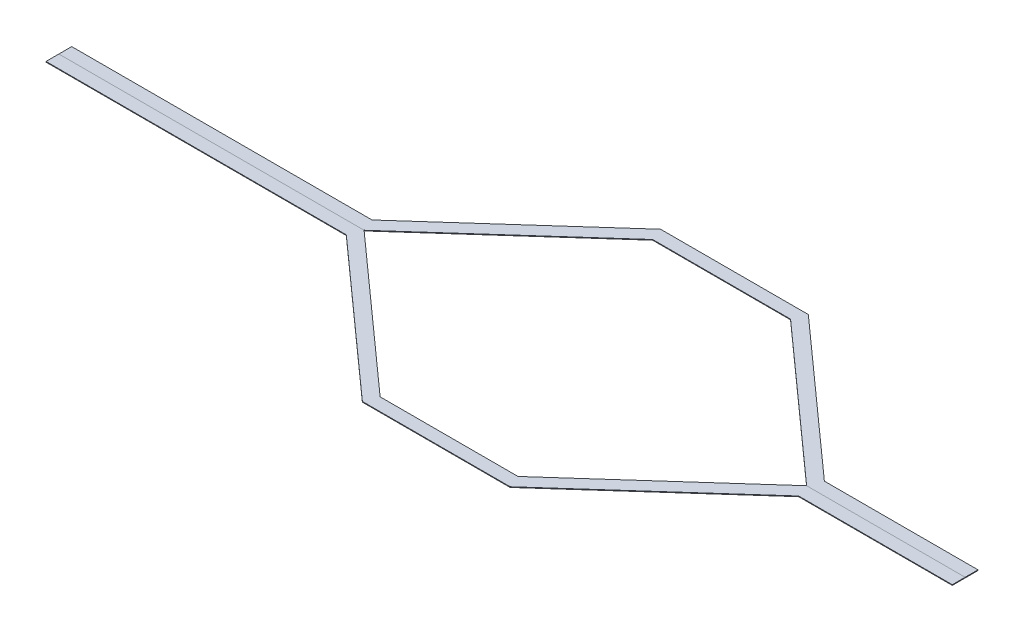
ISO-10303-21;
HEADER;
FILE_DESCRIPTION(('STEP AP214'),'2;1');
FILE_NAME('part.step','',(''),(''),'','','');
FILE_SCHEMA(('AUTOMOTIVE_DESIGN { 1 0 10303 214 1 1 1 1 }'));
ENDSEC;
DATA;
#1=APPLICATION_CONTEXT('core data for automotive mechanical design processes');
#2=APPLICATION_PROTOCOL_DEFINITION('international standard','automotive_design',2000,#1);
#3=PRODUCT_CONTEXT('',#1,'mechanical');
#4=PRODUCT('Part','Part','',(#3));
#5=PRODUCT_RELATED_PRODUCT_CATEGORY('part','',(#4));
#6=PRODUCT_DEFINITION_FORMATION('','',#4);
#7=PRODUCT_DEFINITION_CONTEXT('part definition',#1,'design');
#8=PRODUCT_DEFINITION('design','',#6,#7);
#9=PRODUCT_DEFINITION_SHAPE('','',#8);
#10=(LENGTH_UNIT() NAMED_UNIT(*) SI_UNIT(.MILLI.,.METRE.));
#11=(NAMED_UNIT(*) PLANE_ANGLE_UNIT() SI_UNIT($,.RADIAN.));
#12=(NAMED_UNIT(*) SI_UNIT($,.STERADIAN.) SOLID_ANGLE_UNIT());
#13=UNCERTAINTY_MEASURE_WITH_UNIT(LENGTH_MEASURE(1.E-05),#10,'distance_accuracy_value','');
#14=(GEOMETRIC_REPRESENTATION_CONTEXT(3) GLOBAL_UNCERTAINTY_ASSIGNED_CONTEXT((#13)) GLOBAL_UNIT_ASSIGNED_CONTEXT((#10,
#11,#12)) REPRESENTATION_CONTEXT('',''));
#15=CARTESIAN_POINT('',(0.,0.,0.));
#16=DIRECTION('',(0.,0.,1.));
#17=DIRECTION('',(1.,0.,0.));
#18=AXIS2_PLACEMENT_3D('',#15,#16,#17);
#19=CARTESIAN_POINT('',(0.,2.54,0.));
#20=DIRECTION('',(0.,1.,0.));
#21=DIRECTION('',(0.,0.,1.));
#22=AXIS2_PLACEMENT_3D('',#19,#20,#21);
#23=PLANE('',#22);
#24=DIRECTION('',(-1.,0.,0.));
#25=VECTOR('',#24,1.);
#26=CARTESIAN_POINT('',(0.,2.54,0.));
#27=LINE('',#26,#25);
#28=CARTESIAN_POINT('',(-1206.0932894328,2.54,0.));
#29=VERTEX_POINT('',#28);
#30=CARTESIAN_POINT('',(0.,2.54,0.));
#31=VERTEX_POINT('',#30);
#32=EDGE_CURVE('P0_E157',#29,#31,#27,.F.);
#33=ORIENTED_EDGE('',*,*,#32,.F.);
#34=DIRECTION('',(0.,0.,-1.));
#35=VECTOR('',#34,1.);
#36=CARTESIAN_POINT('',(-1206.0932894328,2.54,0.));
#37=LINE('',#36,#35);
#38=CARTESIAN_POINT('',(-1206.0932894328,2.54,50.8));
#39=VERTEX_POINT('',#38);
#40=EDGE_CURVE('P0_E164',#29,#39,#37,.F.);
#41=ORIENTED_EDGE('',*,*,#40,.T.);
#42=DIRECTION('',(1.,0.,0.));
#43=VECTOR('',#42,1.);
#44=CARTESIAN_POINT('',(0.,2.54,50.7999999999999));
#45=LINE('',#44,#43);
#46=CARTESIAN_POINT('',(-19.4052894327977,2.54,50.7999999999999));
#47=VERTEX_POINT('',#46);
#48=EDGE_CURVE('P0_E118',#47,#39,#45,.F.);
#49=ORIENTED_EDGE('',*,*,#48,.F.);
#50=DIRECTION('',(0.745323557128352,0.,0.666702928739285));
#51=VECTOR('',#50,1.);
#52=CARTESIAN_POINT('',(-33.8685087799556,2.54,37.8624367021202));
#53=LINE('',#52,#51);
#54=CARTESIAN_POINT('',(582.574710567202,2.54,589.28));
#55=VERTEX_POINT('',#54);
#56=EDGE_CURVE('P0_E20',#55,#47,#53,.F.);
#57=ORIENTED_EDGE('',*,*,#56,.F.);
#58=DIRECTION('',(1.,0.,0.));
#59=VECTOR('',#58,1.);
#60=CARTESIAN_POINT('',(1.12085179161461E-13,2.54,589.28));
#61=LINE('',#60,#59);
#62=CARTESIAN_POINT('',(1166.2667105672,2.54,589.28));
#63=VERTEX_POINT('',#62);
#64=EDGE_CURVE('P0_E107',#63,#55,#61,.F.);
#65=ORIENTED_EDGE('',*,*,#64,.F.);
#66=DIRECTION('',(0.745323557128352,0.,-0.666702928739285));
#67=VECTOR('',#66,1.);
#68=CARTESIAN_POINT('',(811.215920403235,2.54,906.878175167768));
#69=LINE('',#68,#67);
#70=CARTESIAN_POINT('',(1768.2467105672,2.54,50.8000000000001));
#71=VERTEX_POINT('',#70);
#72=EDGE_CURVE('P0_E102',#71,#63,#69,.F.);
#73=ORIENTED_EDGE('',*,*,#72,.F.);
#74=DIRECTION('',(1.,0.,0.));
#75=VECTOR('',#74,1.);
#76=CARTESIAN_POINT('',(0.,2.54,50.8000000000003));
#77=LINE('',#76,#75);
#78=CARTESIAN_POINT('',(2375.3067105672,2.54,50.8));
#79=VERTEX_POINT('',#78);
#80=EDGE_CURVE('P0_E129',#79,#71,#77,.F.);
#81=ORIENTED_EDGE('',*,*,#80,.F.);
#82=DIRECTION('',(0.,0.,-1.));
#83=VECTOR('',#82,1.);
#84=CARTESIAN_POINT('',(2375.3067105672,2.54,0.));
#85=LINE('',#84,#83);
#86=CARTESIAN_POINT('',(2375.3067105672,2.54,0.));
#87=VERTEX_POINT('',#86);
#88=EDGE_CURVE('P0_E133',#87,#79,#85,.F.);
#89=ORIENTED_EDGE('',*,*,#88,.F.);
#90=DIRECTION('',(-1.,0.,0.));
#91=VECTOR('',#90,1.);
#92=CARTESIAN_POINT('',(0.,2.54,0.));
#93=LINE('',#92,#91);
#94=CARTESIAN_POINT('',(1748.8414211344,2.54,-1.10593395329907E-13));
#95=VERTEX_POINT('',#94);
#96=EDGE_CURVE('P0_E137',#95,#87,#93,.F.);
#97=ORIENTED_EDGE('',*,*,#96,.F.);
#98=DIRECTION('',(0.745323557128352,0.,-0.666702928739286));
#99=VECTOR('',#98,1.);
#100=CARTESIAN_POINT('',(777.34741162328,2.54,869.015738465648));
#101=LINE('',#100,#99);
#102=CARTESIAN_POINT('',(1146.8614211344,2.54,538.48));
#103=VERTEX_POINT('',#102);
#104=EDGE_CURVE('P0_E144',#95,#103,#101,.F.);
#105=ORIENTED_EDGE('',*,*,#104,.T.);
#106=DIRECTION('',(1.,0.,0.));
#107=VECTOR('',#106,1.);
#108=CARTESIAN_POINT('',(1.09717981034389E-13,2.54,538.48));
#109=LINE('',#108,#107);
#110=CARTESIAN_POINT('',(601.98,2.54,538.48));
#111=VERTEX_POINT('',#110);
#112=EDGE_CURVE('P0_E149',#103,#111,#109,.F.);
#113=ORIENTED_EDGE('',*,*,#112,.T.);
#114=DIRECTION('',(0.745323557128352,0.,0.666702928739285));
#115=VECTOR('',#114,1.);
#116=CARTESIAN_POINT('',(0.,2.54,0.));
#117=LINE('',#116,#115);
#118=EDGE_CURVE('P0_E154',#111,#31,#117,.F.);
#119=ORIENTED_EDGE('',*,*,#118,.T.);
#120=EDGE_LOOP('',(#33,#41,#49,#57,#65,#73,#81,#89,#97,#105,#113,#119));
#121=FACE_BOUND('',#120,.T.);
#122=ADVANCED_FACE('P0_F17',(#121),#23,.T.);
#123=CARTESIAN_POINT('',(-33.8685087799556,2.54,37.8624367021202));
#124=DIRECTION('',(-0.666702928739285,0.,0.745323557128352));
#125=DIRECTION('',(0.745323557128352,0.,0.666702928739285));
#126=AXIS2_PLACEMENT_3D('',#123,#124,#125);
#127=PLANE('',#126);
#128=ORIENTED_EDGE('',*,*,#56,.T.);
#129=DIRECTION('',(0.,1.,0.));
#130=VECTOR('',#129,1.);
#131=CARTESIAN_POINT('',(-19.4052894327978,2.54,50.7999999999999));
#132=LINE('',#131,#130);
#133=CARTESIAN_POINT('',(-19.4052894327977,0.,50.7999999999999));
#134=VERTEX_POINT('',#133);
#135=EDGE_CURVE('P0_E166',#134,#47,#132,.T.);
#136=ORIENTED_EDGE('',*,*,#135,.F.);
#137=DIRECTION('',(0.745323557128352,0.,0.666702928739285));
#138=VECTOR('',#137,1.);
#139=CARTESIAN_POINT('',(-19.4052894327978,0.,50.7999999999998));
#140=LINE('',#139,#138);
#141=CARTESIAN_POINT('',(582.574710567202,0.,589.28));
#142=VERTEX_POINT('',#141);
#143=EDGE_CURVE('P0_E124',#134,#142,#140,.T.);
#144=ORIENTED_EDGE('',*,*,#143,.T.);
#145=DIRECTION('',(0.,1.,0.));
#146=VECTOR('',#145,1.);
#147=CARTESIAN_POINT('',(582.574710567202,2.54,589.28));
#148=LINE('',#147,#146);
#149=EDGE_CURVE('P0_E112',#55,#142,#148,.F.);
#150=ORIENTED_EDGE('',*,*,#149,.F.);
#151=EDGE_LOOP('',(#128,#136,#144,#150));
#152=FACE_BOUND('',#151,.T.);
#153=ADVANCED_FACE('P0_F123',(#152),#127,.T.);
#154=CARTESIAN_POINT('',(1.12085179161461E-13,2.54,589.28));
#155=DIRECTION('',(0.,0.,1.));
#156=DIRECTION('',(1.,0.,0.));
#157=AXIS2_PLACEMENT_3D('',#154,#155,#156);
#158=PLANE('',#157);
#159=ORIENTED_EDGE('',*,*,#64,.T.);
#160=ORIENTED_EDGE('',*,*,#149,.T.);
#161=DIRECTION('',(1.,0.,0.));
#162=VECTOR('',#161,1.);
#163=CARTESIAN_POINT('',(0.,0.,589.28));
#164=LINE('',#163,#162);
#165=CARTESIAN_POINT('',(1166.2667105672,0.,589.28));
#166=VERTEX_POINT('',#165);
#167=EDGE_CURVE('P0_E171',#142,#166,#164,.T.);
#168=ORIENTED_EDGE('',*,*,#167,.T.);
#169=DIRECTION('',(0.,1.,0.));
#170=VECTOR('',#169,1.);
#171=CARTESIAN_POINT('',(1166.2667105672,2.54,589.28));
#172=LINE('',#171,#170);
#173=EDGE_CURVE('P0_E114',#63,#166,#172,.F.);
#174=ORIENTED_EDGE('',*,*,#173,.F.);
#175=EDGE_LOOP('',(#159,#160,#168,#174));
#176=FACE_BOUND('',#175,.T.);
#177=ADVANCED_FACE('P0_F109',(#176),#158,.T.);
#178=CARTESIAN_POINT('',(811.215920403235,2.54,906.878175167768));
#179=DIRECTION('',(0.666702928739285,0.,0.745323557128352));
#180=DIRECTION('',(0.745323557128352,0.,-0.666702928739285));
#181=AXIS2_PLACEMENT_3D('',#178,#179,#180);
#182=PLANE('',#181);
#183=ORIENTED_EDGE('',*,*,#72,.T.);
#184=ORIENTED_EDGE('',*,*,#173,.T.);
#185=DIRECTION('',(0.745323557128352,0.,-0.666702928739285));
#186=VECTOR('',#185,1.);
#187=CARTESIAN_POINT('',(1166.2667105672,0.,589.28));
#188=LINE('',#187,#186);
#189=CARTESIAN_POINT('',(1768.2467105672,0.,50.8000000000001));
#190=VERTEX_POINT('',#189);
#191=EDGE_CURVE('P0_E173',#166,#190,#188,.T.);
#192=ORIENTED_EDGE('',*,*,#191,.T.);
#193=DIRECTION('',(0.,1.,0.));
#194=VECTOR('',#193,1.);
#195=CARTESIAN_POINT('',(1768.2467105672,2.54,50.8000000000001));
#196=LINE('',#195,#194);
#197=EDGE_CURVE('P0_E131',#71,#190,#196,.F.);
#198=ORIENTED_EDGE('',*,*,#197,.F.);
#199=EDGE_LOOP('',(#183,#184,#192,#198));
#200=FACE_BOUND('',#199,.T.);
#201=ADVANCED_FACE('P0_F234',(#200),#182,.T.);
#202=CARTESIAN_POINT('',(0.,2.54,50.8000000000003));
#203=DIRECTION('',(0.,0.,1.));
#204=DIRECTION('',(1.,0.,0.));
#205=AXIS2_PLACEMENT_3D('',#202,#203,#204);
#206=PLANE('',#205);
#207=ORIENTED_EDGE('',*,*,#80,.T.);
#208=ORIENTED_EDGE('',*,*,#197,.T.);
#209=DIRECTION('',(1.,0.,0.));
#210=VECTOR('',#209,1.);
#211=CARTESIAN_POINT('',(0.,0.,50.8000000000001));
#212=LINE('',#211,#210);
#213=CARTESIAN_POINT('',(2375.3067105672,0.,50.8));
#214=VERTEX_POINT('',#213);
#215=EDGE_CURVE('P0_E176',#190,#214,#212,.T.);
#216=ORIENTED_EDGE('',*,*,#215,.T.);
#217=DIRECTION('',(0.,1.,0.));
#218=VECTOR('',#217,1.);
#219=CARTESIAN_POINT('',(2375.3067105672,2.54,50.8));
#220=LINE('',#219,#218);
#221=EDGE_CURVE('P0_E135',#79,#214,#220,.F.);
#222=ORIENTED_EDGE('',*,*,#221,.F.);
#223=EDGE_LOOP('',(#207,#208,#216,#222));
#224=FACE_BOUND('',#223,.T.);
#225=ADVANCED_FACE('P0_F233',(#224),#206,.T.);
#226=CARTESIAN_POINT('',(2375.3067105672,2.54,0.));
#227=DIRECTION('',(1.,0.,0.));
#228=DIRECTION('',(0.,0.,-1.));
#229=AXIS2_PLACEMENT_3D('',#226,#227,#228);
#230=PLANE('',#229);
#231=ORIENTED_EDGE('',*,*,#88,.T.);
#232=ORIENTED_EDGE('',*,*,#221,.T.);
#233=DIRECTION('',(0.,0.,1.));
#234=VECTOR('',#233,1.);
#235=CARTESIAN_POINT('',(2375.3067105672,0.,0.));
#236=LINE('',#235,#234);
#237=CARTESIAN_POINT('',(2375.3067105672,0.,0.));
#238=VERTEX_POINT('',#237);
#239=EDGE_CURVE('P0_E179',#214,#238,#236,.F.);
#240=ORIENTED_EDGE('',*,*,#239,.T.);
#241=DIRECTION('',(0.,1.,0.));
#242=VECTOR('',#241,1.);
#243=CARTESIAN_POINT('',(2375.3067105672,2.54,0.));
#244=LINE('',#243,#242);
#245=EDGE_CURVE('P0_E139',#87,#238,#244,.F.);
#246=ORIENTED_EDGE('',*,*,#245,.F.);
#247=EDGE_LOOP('',(#231,#232,#240,#246));
#248=FACE_BOUND('',#247,.T.);
#249=ADVANCED_FACE('P0_F227',(#248),#230,.T.);
#250=CARTESIAN_POINT('',(0.,2.54,0.));
#251=DIRECTION('',(0.,0.,-1.));
#252=DIRECTION('',(-1.,0.,0.));
#253=AXIS2_PLACEMENT_3D('',#250,#251,#252);
#254=PLANE('',#253);
#255=ORIENTED_EDGE('',*,*,#96,.T.);
#256=ORIENTED_EDGE('',*,*,#245,.T.);
#257=DIRECTION('',(1.,0.,0.));
#258=VECTOR('',#257,1.);
#259=CARTESIAN_POINT('',(0.,0.,0.));
#260=LINE('',#259,#258);
#261=CARTESIAN_POINT('',(1748.8414211344,0.,-1.10593395329907E-13));
#262=VERTEX_POINT('',#261);
#263=EDGE_CURVE('P0_E182',#238,#262,#260,.F.);
#264=ORIENTED_EDGE('',*,*,#263,.T.);
#265=DIRECTION('',(0.,1.,0.));
#266=VECTOR('',#265,1.);
#267=CARTESIAN_POINT('',(1748.8414211344,2.54,-1.11022302462516E-13));
#268=LINE('',#267,#266);
#269=EDGE_CURVE('P0_E141',#262,#95,#268,.T.);
#270=ORIENTED_EDGE('',*,*,#269,.T.);
#271=EDGE_LOOP('',(#255,#256,#264,#270));
#272=FACE_BOUND('',#271,.T.);
#273=ADVANCED_FACE('P0_F223',(#272),#254,.T.);
#274=CARTESIAN_POINT('',(777.34741162328,2.54,869.015738465648));
#275=DIRECTION('',(0.666702928739286,0.,0.745323557128352));
#276=DIRECTION('',(0.745323557128352,0.,-0.666702928739286));
#277=AXIS2_PLACEMENT_3D('',#274,#275,#276);
#278=PLANE('',#277);
#279=DIRECTION('',(0.,1.,0.));
#280=VECTOR('',#279,1.);
#281=CARTESIAN_POINT('',(1146.8614211344,2.54,538.48));
#282=LINE('',#281,#280);
#283=CARTESIAN_POINT('',(1146.8614211344,0.,538.48));
#284=VERTEX_POINT('',#283);
#285=EDGE_CURVE('P0_E146',#284,#103,#282,.T.);
#286=ORIENTED_EDGE('',*,*,#285,.T.);
#287=ORIENTED_EDGE('',*,*,#104,.F.);
#288=ORIENTED_EDGE('',*,*,#269,.F.);
#289=DIRECTION('',(-0.745323557128352,0.,0.666702928739285));
#290=VECTOR('',#289,1.);
#291=CARTESIAN_POINT('',(1748.8414211344,0.,0.));
#292=LINE('',#291,#290);
#293=EDGE_CURVE('P0_E185',#262,#284,#292,.T.);
#294=ORIENTED_EDGE('',*,*,#293,.T.);
#295=EDGE_LOOP('',(#286,#287,#288,#294));
#296=FACE_BOUND('',#295,.T.);
#297=ADVANCED_FACE('P0_F219',(#296),#278,.F.);
#298=CARTESIAN_POINT('',(1.09717981034389E-13,2.54,538.48));
#299=DIRECTION('',(0.,0.,1.));
#300=DIRECTION('',(1.,0.,0.));
#301=AXIS2_PLACEMENT_3D('',#298,#299,#300);
#302=PLANE('',#301);
#303=DIRECTION('',(0.,1.,0.));
#304=VECTOR('',#303,1.);
#305=CARTESIAN_POINT('',(601.98,2.54,538.48));
#306=LINE('',#305,#304);
#307=CARTESIAN_POINT('',(601.98,0.,538.48));
#308=VERTEX_POINT('',#307);
#309=EDGE_CURVE('P0_E151',#308,#111,#306,.T.);
#310=ORIENTED_EDGE('',*,*,#309,.T.);
#311=ORIENTED_EDGE('',*,*,#112,.F.);
#312=ORIENTED_EDGE('',*,*,#285,.F.);
#313=DIRECTION('',(1.,0.,0.));
#314=VECTOR('',#313,1.);
#315=CARTESIAN_POINT('',(0.,0.,538.48));
#316=LINE('',#315,#314);
#317=EDGE_CURVE('P0_E188',#284,#308,#316,.F.);
#318=ORIENTED_EDGE('',*,*,#317,.T.);
#319=EDGE_LOOP('',(#310,#311,#312,#318));
#320=FACE_BOUND('',#319,.T.);
#321=ADVANCED_FACE('P0_F215',(#320),#302,.F.);
#322=CARTESIAN_POINT('',(0.,2.54,0.));
#323=DIRECTION('',(-0.666702928739285,0.,0.745323557128352));
#324=DIRECTION('',(0.745323557128352,0.,0.666702928739285));
#325=AXIS2_PLACEMENT_3D('',#322,#323,#324);
#326=PLANE('',#325);
#327=DIRECTION('',(0.,1.,0.));
#328=VECTOR('',#327,1.);
#329=CARTESIAN_POINT('',(0.,2.54,0.));
#330=LINE('',#329,#328);
#331=CARTESIAN_POINT('',(0.,0.,0.));
#332=VERTEX_POINT('',#331);
#333=EDGE_CURVE('P0_E159',#31,#332,#330,.F.);
#334=ORIENTED_EDGE('',*,*,#333,.F.);
#335=ORIENTED_EDGE('',*,*,#118,.F.);
#336=ORIENTED_EDGE('',*,*,#309,.F.);
#337=DIRECTION('',(-0.745323557128352,0.,-0.666702928739285));
#338=VECTOR('',#337,1.);
#339=CARTESIAN_POINT('',(601.98,0.,538.48));
#340=LINE('',#339,#338);
#341=EDGE_CURVE('P0_E191',#308,#332,#340,.T.);
#342=ORIENTED_EDGE('',*,*,#341,.T.);
#343=EDGE_LOOP('',(#334,#335,#336,#342));
#344=FACE_BOUND('',#343,.T.);
#345=ADVANCED_FACE('P0_F211',(#344),#326,.F.);
#346=CARTESIAN_POINT('',(0.,2.54,0.));
#347=DIRECTION('',(0.,0.,-1.));
#348=DIRECTION('',(-1.,0.,0.));
#349=AXIS2_PLACEMENT_3D('',#346,#347,#348);
#350=PLANE('',#349);
#351=ORIENTED_EDGE('',*,*,#32,.T.);
#352=ORIENTED_EDGE('',*,*,#333,.T.);
#353=DIRECTION('',(1.,0.,0.));
#354=VECTOR('',#353,1.);
#355=CARTESIAN_POINT('',(0.,0.,0.));
#356=LINE('',#355,#354);
#357=CARTESIAN_POINT('',(-1206.0932894328,0.,0.));
#358=VERTEX_POINT('',#357);
#359=EDGE_CURVE('P0_E194',#332,#358,#356,.F.);
#360=ORIENTED_EDGE('',*,*,#359,.T.);
#361=DIRECTION('',(0.,1.,0.));
#362=VECTOR('',#361,1.);
#363=CARTESIAN_POINT('',(-1206.0932894328,2.54,0.));
#364=LINE('',#363,#362);
#365=EDGE_CURVE('P0_E161',#358,#29,#364,.T.);
#366=ORIENTED_EDGE('',*,*,#365,.T.);
#367=EDGE_LOOP('',(#351,#352,#360,#366));
#368=FACE_BOUND('',#367,.T.);
#369=ADVANCED_FACE('P0_F207',(#368),#350,.T.);
#370=CARTESIAN_POINT('',(-1206.0932894328,2.54,0.));
#371=DIRECTION('',(1.,0.,0.));
#372=DIRECTION('',(0.,0.,-1.));
#373=AXIS2_PLACEMENT_3D('',#370,#371,#372);
#374=PLANE('',#373);
#375=DIRECTION('',(0.,1.,0.));
#376=VECTOR('',#375,1.);
#377=CARTESIAN_POINT('',(-1206.0932894328,2.54,50.8));
#378=LINE('',#377,#376);
#379=CARTESIAN_POINT('',(-1206.0932894328,0.,50.8));
#380=VERTEX_POINT('',#379);
#381=EDGE_CURVE('P0_E34',#39,#380,#378,.F.);
#382=ORIENTED_EDGE('',*,*,#381,.F.);
#383=ORIENTED_EDGE('',*,*,#40,.F.);
#384=ORIENTED_EDGE('',*,*,#365,.F.);
#385=DIRECTION('',(0.,0.,1.));
#386=VECTOR('',#385,1.);
#387=CARTESIAN_POINT('',(-1206.0932894328,0.,0.));
#388=LINE('',#387,#386);
#389=EDGE_CURVE('P0_E26',#358,#380,#388,.T.);
#390=ORIENTED_EDGE('',*,*,#389,.T.);
#391=EDGE_LOOP('',(#382,#383,#384,#390));
#392=FACE_BOUND('',#391,.T.);
#393=ADVANCED_FACE('P0_F200',(#392),#374,.F.);
#394=CARTESIAN_POINT('',(0.,2.54,50.7999999999999));
#395=DIRECTION('',(0.,0.,1.));
#396=DIRECTION('',(1.,0.,0.));
#397=AXIS2_PLACEMENT_3D('',#394,#395,#396);
#398=PLANE('',#397);
#399=ORIENTED_EDGE('',*,*,#48,.T.);
#400=ORIENTED_EDGE('',*,*,#381,.T.);
#401=DIRECTION('',(1.,0.,0.));
#402=VECTOR('',#401,1.);
#403=CARTESIAN_POINT('',(0.,0.,50.8));
#404=LINE('',#403,#402);
#405=EDGE_CURVE('P0_E11',#380,#134,#404,.T.);
#406=ORIENTED_EDGE('',*,*,#405,.T.);
#407=ORIENTED_EDGE('',*,*,#135,.T.);
#408=EDGE_LOOP('',(#399,#400,#406,#407));
#409=FACE_BOUND('',#408,.T.);
#410=ADVANCED_FACE('P0_F235',(#409),#398,.T.);
#411=CARTESIAN_POINT('',(0.,0.,0.));
#412=DIRECTION('',(0.,1.,0.));
#413=DIRECTION('',(0.,0.,1.));
#414=AXIS2_PLACEMENT_3D('',#411,#412,#413);
#415=PLANE('',#414);
#416=ORIENTED_EDGE('',*,*,#389,.F.);
#417=ORIENTED_EDGE('',*,*,#359,.F.);
#418=ORIENTED_EDGE('',*,*,#341,.F.);
#419=ORIENTED_EDGE('',*,*,#317,.F.);
#420=ORIENTED_EDGE('',*,*,#293,.F.);
#421=ORIENTED_EDGE('',*,*,#263,.F.);
#422=ORIENTED_EDGE('',*,*,#239,.F.);
#423=ORIENTED_EDGE('',*,*,#215,.F.);
#424=ORIENTED_EDGE('',*,*,#191,.F.);
#425=ORIENTED_EDGE('',*,*,#167,.F.);
#426=ORIENTED_EDGE('',*,*,#143,.F.);
#427=ORIENTED_EDGE('',*,*,#405,.F.);
#428=EDGE_LOOP('',(#416,#417,#418,#419,#420,#421,#422,#423,#424,#425,#426,#427));
#429=FACE_BOUND('',#428,.T.);
#430=ADVANCED_FACE('P0_F204',(#429),#415,.F.);
#431=CLOSED_SHELL('',(#122,#153,#177,#201,#225,#249,#273,#297,#321,#345,#369,#393,#410,#430));
#432=MANIFOLD_SOLID_BREP('P0_B1',#431);
#433=CARTESIAN_POINT('',(0.,2.54,0.));
#434=DIRECTION('',(0.,1.,0.));
#435=DIRECTION('',(0.,0.,1.));
#436=AXIS2_PLACEMENT_3D('',#433,#434,#435);
#437=PLANE('',#436);
#438=DIRECTION('',(-1.,0.,0.));
#439=VECTOR('',#438,1.);
#440=CARTESIAN_POINT('',(0.,2.54,0.));
#441=LINE('',#440,#439);
#442=CARTESIAN_POINT('',(1748.8414211344,2.54,0.));
#443=VERTEX_POINT('',#442);
#444=CARTESIAN_POINT('',(2375.3067105672,2.54,0.));
#445=VERTEX_POINT('',#444);
#446=EDGE_CURVE('P1_E162',#443,#445,#441,.F.);
#447=ORIENTED_EDGE('',*,*,#446,.T.);
#448=DIRECTION('',(0.,0.,-1.));
#449=VECTOR('',#448,1.);
#450=CARTESIAN_POINT('',(2375.3067105672,2.54,0.));
#451=LINE('',#450,#449);
#452=CARTESIAN_POINT('',(2375.3067105672,2.54,-50.8));
#453=VERTEX_POINT('',#452);
#454=EDGE_CURVE('P1_E164',#453,#445,#451,.F.);
#455=ORIENTED_EDGE('',*,*,#454,.F.);
#456=DIRECTION('',(-1.,0.,0.));
#457=VECTOR('',#456,1.);
#458=CARTESIAN_POINT('',(0.,2.54,-50.8));
#459=LINE('',#458,#457);
#460=CARTESIAN_POINT('',(1768.2467105672,2.54,-50.8000000000003));
#461=VERTEX_POINT('',#460);
#462=EDGE_CURVE('P1_E119',#461,#453,#459,.F.);
#463=ORIENTED_EDGE('',*,*,#462,.F.);
#464=DIRECTION('',(-0.745323557128352,0.,-0.666702928739285));
#465=VECTOR('',#464,1.);
#466=CARTESIAN_POINT('',(811.215920403235,2.54,-906.878175167768));
#467=LINE('',#466,#465);
#468=CARTESIAN_POINT('',(1166.2667105672,2.54,-589.28));
#469=VERTEX_POINT('',#468);
#470=EDGE_CURVE('P1_E20',#469,#461,#467,.F.);
#471=ORIENTED_EDGE('',*,*,#470,.F.);
#472=DIRECTION('',(-1.,0.,0.));
#473=VECTOR('',#472,1.);
#474=CARTESIAN_POINT('',(0.,2.54,-589.28));
#475=LINE('',#474,#473);
#476=CARTESIAN_POINT('',(582.574710567202,2.54,-589.28));
#477=VERTEX_POINT('',#476);
#478=EDGE_CURVE('P1_E107',#477,#469,#475,.F.);
#479=ORIENTED_EDGE('',*,*,#478,.F.);
#480=DIRECTION('',(-0.745323557128352,0.,0.666702928739285));
#481=VECTOR('',#480,1.);
#482=CARTESIAN_POINT('',(-33.8685087799557,2.54,-37.8624367021203));
#483=LINE('',#482,#481);
#484=CARTESIAN_POINT('',(-19.4052894327977,2.54,-50.8));
#485=VERTEX_POINT('',#484);
#486=EDGE_CURVE('P1_E102',#485,#477,#483,.F.);
#487=ORIENTED_EDGE('',*,*,#486,.F.);
#488=DIRECTION('',(-1.,0.,0.));
#489=VECTOR('',#488,1.);
#490=CARTESIAN_POINT('',(0.,2.54,-50.8));
#491=LINE('',#490,#489);
#492=CARTESIAN_POINT('',(-1206.0932894328,2.54,-50.8));
#493=VERTEX_POINT('',#492);
#494=EDGE_CURVE('P1_E130',#493,#485,#491,.F.);
#495=ORIENTED_EDGE('',*,*,#494,.F.);
#496=DIRECTION('',(0.,0.,-1.));
#497=VECTOR('',#496,1.);
#498=CARTESIAN_POINT('',(-1206.0932894328,2.54,0.));
#499=LINE('',#498,#497);
#500=CARTESIAN_POINT('',(-1206.0932894328,2.54,0.));
#501=VERTEX_POINT('',#500);
#502=EDGE_CURVE('P1_E137',#493,#501,#499,.F.);
#503=ORIENTED_EDGE('',*,*,#502,.T.);
#504=DIRECTION('',(-1.,0.,0.));
#505=VECTOR('',#504,1.);
#506=CARTESIAN_POINT('',(0.,2.54,0.));
#507=LINE('',#506,#505);
#508=CARTESIAN_POINT('',(0.,2.54,0.));
#509=VERTEX_POINT('',#508);
#510=EDGE_CURVE('P1_E142',#501,#509,#507,.F.);
#511=ORIENTED_EDGE('',*,*,#510,.T.);
#512=DIRECTION('',(-0.745323557128352,0.,0.666702928739285));
#513=VECTOR('',#512,1.);
#514=CARTESIAN_POINT('',(0.,2.54,0.));
#515=LINE('',#514,#513);
#516=CARTESIAN_POINT('',(601.98,2.54,-538.48));
#517=VERTEX_POINT('',#516);
#518=EDGE_CURVE('P1_E147',#509,#517,#515,.F.);
#519=ORIENTED_EDGE('',*,*,#518,.T.);
#520=DIRECTION('',(-1.,0.,0.));
#521=VECTOR('',#520,1.);
#522=CARTESIAN_POINT('',(0.,2.54,-538.48));
#523=LINE('',#522,#521);
#524=CARTESIAN_POINT('',(1146.8614211344,2.54,-538.48));
#525=VERTEX_POINT('',#524);
#526=EDGE_CURVE('P1_E152',#517,#525,#523,.F.);
#527=ORIENTED_EDGE('',*,*,#526,.T.);
#528=DIRECTION('',(-0.745323557128352,0.,-0.666702928739285));
#529=VECTOR('',#528,1.);
#530=CARTESIAN_POINT('',(777.34741162328,2.54,-869.015738465647));
#531=LINE('',#530,#529);
#532=EDGE_CURVE('P1_E157',#525,#443,#531,.F.);
#533=ORIENTED_EDGE('',*,*,#532,.T.);
#534=EDGE_LOOP('',(#447,#455,#463,#471,#479,#487,#495,#503,#511,#519,#527,#533));
#535=FACE_BOUND('',#534,.T.);
#536=ADVANCED_FACE('P1_F17',(#535),#437,.T.);
#537=CARTESIAN_POINT('',(811.215920403235,2.54,-906.878175167768));
#538=DIRECTION('',(0.666702928739285,0.,-0.745323557128352));
#539=DIRECTION('',(-0.745323557128352,0.,-0.666702928739285));
#540=AXIS2_PLACEMENT_3D('',#537,#538,#539);
#541=PLANE('',#540);
#542=ORIENTED_EDGE('',*,*,#470,.T.);
#543=DIRECTION('',(0.,1.,0.));
#544=VECTOR('',#543,1.);
#545=CARTESIAN_POINT('',(1768.2467105672,2.54,-50.8));
#546=LINE('',#545,#544);
#547=CARTESIAN_POINT('',(1768.2467105672,0.,-50.8000000000003));
#548=VERTEX_POINT('',#547);
#549=EDGE_CURVE('P1_E168',#548,#461,#546,.T.);
#550=ORIENTED_EDGE('',*,*,#549,.F.);
#551=DIRECTION('',(-0.745323557128352,0.,-0.666702928739285));
#552=VECTOR('',#551,1.);
#553=CARTESIAN_POINT('',(1768.2467105672,0.,-50.8000000000004));
#554=LINE('',#553,#552);
#555=CARTESIAN_POINT('',(1166.2667105672,0.,-589.28));
#556=VERTEX_POINT('',#555);
#557=EDGE_CURVE('P1_E125',#548,#556,#554,.T.);
#558=ORIENTED_EDGE('',*,*,#557,.T.);
#559=DIRECTION('',(0.,1.,0.));
#560=VECTOR('',#559,1.);
#561=CARTESIAN_POINT('',(1166.2667105672,2.54,-589.28));
#562=LINE('',#561,#560);
#563=EDGE_CURVE('P1_E112',#469,#556,#562,.F.);
#564=ORIENTED_EDGE('',*,*,#563,.F.);
#565=EDGE_LOOP('',(#542,#550,#558,#564));
#566=FACE_BOUND('',#565,.T.);
#567=ADVANCED_FACE('P1_F124',(#566),#541,.T.);
#568=CARTESIAN_POINT('',(0.,2.54,-589.28));
#569=DIRECTION('',(0.,0.,-1.));
#570=DIRECTION('',(-1.,0.,0.));
#571=AXIS2_PLACEMENT_3D('',#568,#569,#570);
#572=PLANE('',#571);
#573=ORIENTED_EDGE('',*,*,#478,.T.);
#574=ORIENTED_EDGE('',*,*,#563,.T.);
#575=DIRECTION('',(1.,0.,0.));
#576=VECTOR('',#575,1.);
#577=CARTESIAN_POINT('',(0.,0.,-589.28));
#578=LINE('',#577,#576);
#579=CARTESIAN_POINT('',(582.574710567202,0.,-589.28));
#580=VERTEX_POINT('',#579);
#581=EDGE_CURVE('P1_E173',#556,#580,#578,.F.);
#582=ORIENTED_EDGE('',*,*,#581,.T.);
#583=DIRECTION('',(0.,1.,0.));
#584=VECTOR('',#583,1.);
#585=CARTESIAN_POINT('',(582.574710567202,2.54,-589.28));
#586=LINE('',#585,#584);
#587=EDGE_CURVE('P1_E114',#477,#580,#586,.F.);
#588=ORIENTED_EDGE('',*,*,#587,.F.);
#589=EDGE_LOOP('',(#573,#574,#582,#588));
#590=FACE_BOUND('',#589,.T.);
#591=ADVANCED_FACE('P1_F109',(#590),#572,.T.);
#592=CARTESIAN_POINT('',(-33.8685087799557,2.54,-37.8624367021203));
#593=DIRECTION('',(-0.666702928739285,0.,-0.745323557128352));
#594=DIRECTION('',(-0.745323557128352,0.,0.666702928739285));
#595=AXIS2_PLACEMENT_3D('',#592,#593,#594);
#596=PLANE('',#595);
#597=ORIENTED_EDGE('',*,*,#486,.T.);
#598=ORIENTED_EDGE('',*,*,#587,.T.);
#599=DIRECTION('',(-0.745323557128352,0.,0.666702928739285));
#600=VECTOR('',#599,1.);
#601=CARTESIAN_POINT('',(582.574710567202,0.,-589.28));
#602=LINE('',#601,#600);
#603=CARTESIAN_POINT('',(-19.4052894327978,0.,-50.8));
#604=VERTEX_POINT('',#603);
#605=EDGE_CURVE('P1_E175',#580,#604,#602,.T.);
#606=ORIENTED_EDGE('',*,*,#605,.T.);
#607=DIRECTION('',(0.,1.,0.));
#608=VECTOR('',#607,1.);
#609=CARTESIAN_POINT('',(-19.4052894327978,2.54,-50.8));
#610=LINE('',#609,#608);
#611=EDGE_CURVE('P1_E132',#485,#604,#610,.F.);
#612=ORIENTED_EDGE('',*,*,#611,.F.);
#613=EDGE_LOOP('',(#597,#598,#606,#612));
#614=FACE_BOUND('',#613,.T.);
#615=ADVANCED_FACE('P1_F234',(#614),#596,.T.);
#616=CARTESIAN_POINT('',(0.,2.54,-50.8));
#617=DIRECTION('',(0.,0.,-1.));
#618=DIRECTION('',(-1.,0.,0.));
#619=AXIS2_PLACEMENT_3D('',#616,#617,#618);
#620=PLANE('',#619);
#621=ORIENTED_EDGE('',*,*,#494,.T.);
#622=ORIENTED_EDGE('',*,*,#611,.T.);
#623=DIRECTION('',(1.,0.,0.));
#624=VECTOR('',#623,1.);
#625=CARTESIAN_POINT('',(0.,0.,-50.8));
#626=LINE('',#625,#624);
#627=CARTESIAN_POINT('',(-1206.0932894328,0.,-50.8));
#628=VERTEX_POINT('',#627);
#629=EDGE_CURVE('P1_E178',#604,#628,#626,.F.);
#630=ORIENTED_EDGE('',*,*,#629,.T.);
#631=DIRECTION('',(0.,1.,0.));
#632=VECTOR('',#631,1.);
#633=CARTESIAN_POINT('',(-1206.0932894328,2.54,-50.8));
#634=LINE('',#633,#632);
#635=EDGE_CURVE('P1_E134',#628,#493,#634,.T.);
#636=ORIENTED_EDGE('',*,*,#635,.T.);
#637=EDGE_LOOP('',(#621,#622,#630,#636));
#638=FACE_BOUND('',#637,.T.);
#639=ADVANCED_FACE('P1_F233',(#638),#620,.T.);
#640=CARTESIAN_POINT('',(-1206.0932894328,2.54,0.));
#641=DIRECTION('',(1.,0.,0.));
#642=DIRECTION('',(0.,0.,-1.));
#643=AXIS2_PLACEMENT_3D('',#640,#641,#642);
#644=PLANE('',#643);
#645=DIRECTION('',(0.,1.,0.));
#646=VECTOR('',#645,1.);
#647=CARTESIAN_POINT('',(-1206.0932894328,2.54,0.));
#648=LINE('',#647,#646);
#649=CARTESIAN_POINT('',(-1206.0932894328,0.,0.));
#650=VERTEX_POINT('',#649);
#651=EDGE_CURVE('P1_E139',#650,#501,#648,.T.);
#652=ORIENTED_EDGE('',*,*,#651,.T.);
#653=ORIENTED_EDGE('',*,*,#502,.F.);
#654=ORIENTED_EDGE('',*,*,#635,.F.);
#655=DIRECTION('',(0.,0.,1.));
#656=VECTOR('',#655,1.);
#657=CARTESIAN_POINT('',(-1206.0932894328,0.,0.));
#658=LINE('',#657,#656);
#659=EDGE_CURVE('P1_E181',#628,#650,#658,.T.);
#660=ORIENTED_EDGE('',*,*,#659,.T.);
#661=EDGE_LOOP('',(#652,#653,#654,#660));
#662=FACE_BOUND('',#661,.T.);
#663=ADVANCED_FACE('P1_F229',(#662),#644,.F.);
#664=CARTESIAN_POINT('',(0.,2.54,0.));
#665=DIRECTION('',(0.,0.,-1.));
#666=DIRECTION('',(-1.,0.,0.));
#667=AXIS2_PLACEMENT_3D('',#664,#665,#666);
#668=PLANE('',#667);
#669=DIRECTION('',(0.,1.,0.));
#670=VECTOR('',#669,1.);
#671=CARTESIAN_POINT('',(0.,2.54,0.));
#672=LINE('',#671,#670);
#673=CARTESIAN_POINT('',(0.,0.,0.));
#674=VERTEX_POINT('',#673);
#675=EDGE_CURVE('P1_E144',#674,#509,#672,.T.);
#676=ORIENTED_EDGE('',*,*,#675,.T.);
#677=ORIENTED_EDGE('',*,*,#510,.F.);
#678=ORIENTED_EDGE('',*,*,#651,.F.);
#679=DIRECTION('',(1.,0.,0.));
#680=VECTOR('',#679,1.);
#681=CARTESIAN_POINT('',(0.,0.,0.));
#682=LINE('',#681,#680);
#683=EDGE_CURVE('P1_E184',#650,#674,#682,.T.);
#684=ORIENTED_EDGE('',*,*,#683,.T.);
#685=EDGE_LOOP('',(#676,#677,#678,#684));
#686=FACE_BOUND('',#685,.T.);
#687=ADVANCED_FACE('P1_F225',(#686),#668,.F.);
#688=CARTESIAN_POINT('',(0.,2.54,0.));
#689=DIRECTION('',(-0.666702928739285,0.,-0.745323557128352));
#690=DIRECTION('',(-0.745323557128352,0.,0.666702928739285));
#691=AXIS2_PLACEMENT_3D('',#688,#689,#690);
#692=PLANE('',#691);
#693=DIRECTION('',(0.,1.,0.));
#694=VECTOR('',#693,1.);
#695=CARTESIAN_POINT('',(601.98,2.54,-538.48));
#696=LINE('',#695,#694);
#697=CARTESIAN_POINT('',(601.98,0.,-538.48));
#698=VERTEX_POINT('',#697);
#699=EDGE_CURVE('P1_E149',#698,#517,#696,.T.);
#700=ORIENTED_EDGE('',*,*,#699,.T.);
#701=ORIENTED_EDGE('',*,*,#518,.F.);
#702=ORIENTED_EDGE('',*,*,#675,.F.);
#703=DIRECTION('',(0.745323557128352,0.,-0.666702928739285));
#704=VECTOR('',#703,1.);
#705=CARTESIAN_POINT('',(0.,0.,0.));
#706=LINE('',#705,#704);
#707=EDGE_CURVE('P1_E187',#674,#698,#706,.T.);
#708=ORIENTED_EDGE('',*,*,#707,.T.);
#709=EDGE_LOOP('',(#700,#701,#702,#708));
#710=FACE_BOUND('',#709,.T.);
#711=ADVANCED_FACE('P1_F221',(#710),#692,.F.);
#712=CARTESIAN_POINT('',(0.,2.54,-538.48));
#713=DIRECTION('',(0.,0.,-1.));
#714=DIRECTION('',(-1.,0.,0.));
#715=AXIS2_PLACEMENT_3D('',#712,#713,#714);
#716=PLANE('',#715);
#717=DIRECTION('',(0.,1.,0.));
#718=VECTOR('',#717,1.);
#719=CARTESIAN_POINT('',(1146.8614211344,2.54,-538.48));
#720=LINE('',#719,#718);
#721=CARTESIAN_POINT('',(1146.8614211344,0.,-538.48));
#722=VERTEX_POINT('',#721);
#723=EDGE_CURVE('P1_E154',#722,#525,#720,.T.);
#724=ORIENTED_EDGE('',*,*,#723,.T.);
#725=ORIENTED_EDGE('',*,*,#526,.F.);
#726=ORIENTED_EDGE('',*,*,#699,.F.);
#727=DIRECTION('',(1.,0.,0.));
#728=VECTOR('',#727,1.);
#729=CARTESIAN_POINT('',(0.,0.,-538.48));
#730=LINE('',#729,#728);
#731=EDGE_CURVE('P1_E190',#698,#722,#730,.T.);
#732=ORIENTED_EDGE('',*,*,#731,.T.);
#733=EDGE_LOOP('',(#724,#725,#726,#732));
#734=FACE_BOUND('',#733,.T.);
#735=ADVANCED_FACE('P1_F217',(#734),#716,.F.);
#736=CARTESIAN_POINT('',(777.34741162328,2.54,-869.015738465647));
#737=DIRECTION('',(0.666702928739285,0.,-0.745323557128352));
#738=DIRECTION('',(-0.745323557128352,0.,-0.666702928739285));
#739=AXIS2_PLACEMENT_3D('',#736,#737,#738);
#740=PLANE('',#739);
#741=DIRECTION('',(0.,1.,0.));
#742=VECTOR('',#741,1.);
#743=CARTESIAN_POINT('',(1748.8414211344,2.54,0.));
#744=LINE('',#743,#742);
#745=CARTESIAN_POINT('',(1748.8414211344,0.,1.94289029309402E-13));
#746=VERTEX_POINT('',#745);
#747=EDGE_CURVE('P1_E159',#746,#443,#744,.T.);
#748=ORIENTED_EDGE('',*,*,#747,.T.);
#749=ORIENTED_EDGE('',*,*,#532,.F.);
#750=ORIENTED_EDGE('',*,*,#723,.F.);
#751=DIRECTION('',(0.745323557128352,0.,0.666702928739285));
#752=VECTOR('',#751,1.);
#753=CARTESIAN_POINT('',(1146.8614211344,0.,-538.48));
#754=LINE('',#753,#752);
#755=EDGE_CURVE('P1_E193',#722,#746,#754,.T.);
#756=ORIENTED_EDGE('',*,*,#755,.T.);
#757=EDGE_LOOP('',(#748,#749,#750,#756));
#758=FACE_BOUND('',#757,.T.);
#759=ADVANCED_FACE('P1_F213',(#758),#740,.F.);
#760=CARTESIAN_POINT('',(0.,2.54,0.));
#761=DIRECTION('',(0.,0.,-1.));
#762=DIRECTION('',(-1.,0.,0.));
#763=AXIS2_PLACEMENT_3D('',#760,#761,#762);
#764=PLANE('',#763);
#765=DIRECTION('',(0.,1.,0.));
#766=VECTOR('',#765,1.);
#767=CARTESIAN_POINT('',(2375.3067105672,2.54,0.));
#768=LINE('',#767,#766);
#769=CARTESIAN_POINT('',(2375.3067105672,0.,0.));
#770=VERTEX_POINT('',#769);
#771=EDGE_CURVE('P1_E166',#445,#770,#768,.F.);
#772=ORIENTED_EDGE('',*,*,#771,.F.);
#773=ORIENTED_EDGE('',*,*,#446,.F.);
#774=ORIENTED_EDGE('',*,*,#747,.F.);
#775=DIRECTION('',(1.,0.,0.));
#776=VECTOR('',#775,1.);
#777=CARTESIAN_POINT('',(0.,0.,0.));
#778=LINE('',#777,#776);
#779=EDGE_CURVE('P1_E196',#746,#770,#778,.T.);
#780=ORIENTED_EDGE('',*,*,#779,.T.);
#781=EDGE_LOOP('',(#772,#773,#774,#780));
#782=FACE_BOUND('',#781,.T.);
#783=ADVANCED_FACE('P1_F209',(#782),#764,.F.);
#784=CARTESIAN_POINT('',(2375.3067105672,2.54,0.));
#785=DIRECTION('',(1.,0.,0.));
#786=DIRECTION('',(0.,0.,-1.));
#787=AXIS2_PLACEMENT_3D('',#784,#785,#786);
#788=PLANE('',#787);
#789=ORIENTED_EDGE('',*,*,#454,.T.);
#790=ORIENTED_EDGE('',*,*,#771,.T.);
#791=DIRECTION('',(0.,0.,1.));
#792=VECTOR('',#791,1.);
#793=CARTESIAN_POINT('',(2375.3067105672,0.,0.));
#794=LINE('',#793,#792);
#795=CARTESIAN_POINT('',(2375.3067105672,0.,-50.8));
#796=VERTEX_POINT('',#795);
#797=EDGE_CURVE('P1_E26',#770,#796,#794,.F.);
#798=ORIENTED_EDGE('',*,*,#797,.T.);
#799=DIRECTION('',(0.,1.,0.));
#800=VECTOR('',#799,1.);
#801=CARTESIAN_POINT('',(2375.3067105672,2.54,-50.8));
#802=LINE('',#801,#800);
#803=EDGE_CURVE('P1_E34',#453,#796,#802,.F.);
#804=ORIENTED_EDGE('',*,*,#803,.F.);
#805=EDGE_LOOP('',(#789,#790,#798,#804));
#806=FACE_BOUND('',#805,.T.);
#807=ADVANCED_FACE('P1_F202',(#806),#788,.T.);
#808=CARTESIAN_POINT('',(0.,2.54,-50.8));
#809=DIRECTION('',(0.,0.,-1.));
#810=DIRECTION('',(-1.,0.,0.));
#811=AXIS2_PLACEMENT_3D('',#808,#809,#810);
#812=PLANE('',#811);
#813=ORIENTED_EDGE('',*,*,#462,.T.);
#814=ORIENTED_EDGE('',*,*,#803,.T.);
#815=DIRECTION('',(1.,0.,0.));
#816=VECTOR('',#815,1.);
#817=CARTESIAN_POINT('',(0.,0.,-50.8));
#818=LINE('',#817,#816);
#819=EDGE_CURVE('P1_E11',#796,#548,#818,.F.);
#820=ORIENTED_EDGE('',*,*,#819,.T.);
#821=ORIENTED_EDGE('',*,*,#549,.T.);
#822=EDGE_LOOP('',(#813,#814,#820,#821));
#823=FACE_BOUND('',#822,.T.);
#824=ADVANCED_FACE('P1_F235',(#823),#812,.T.);
#825=CARTESIAN_POINT('',(0.,0.,0.));
#826=DIRECTION('',(0.,1.,0.));
#827=DIRECTION('',(0.,0.,1.));
#828=AXIS2_PLACEMENT_3D('',#825,#826,#827);
#829=PLANE('',#828);
#830=ORIENTED_EDGE('',*,*,#797,.F.);
#831=ORIENTED_EDGE('',*,*,#779,.F.);
#832=ORIENTED_EDGE('',*,*,#755,.F.);
#833=ORIENTED_EDGE('',*,*,#731,.F.);
#834=ORIENTED_EDGE('',*,*,#707,.F.);
#835=ORIENTED_EDGE('',*,*,#683,.F.);
#836=ORIENTED_EDGE('',*,*,#659,.F.);
#837=ORIENTED_EDGE('',*,*,#629,.F.);
#838=ORIENTED_EDGE('',*,*,#605,.F.);
#839=ORIENTED_EDGE('',*,*,#581,.F.);
#840=ORIENTED_EDGE('',*,*,#557,.F.);
#841=ORIENTED_EDGE('',*,*,#819,.F.);
#842=EDGE_LOOP('',(#830,#831,#832,#833,#834,#835,#836,#837,#838,#839,#840,#841));
#843=FACE_BOUND('',#842,.T.);
#844=ADVANCED_FACE('P1_F206',(#843),#829,.F.);
#845=CLOSED_SHELL('',(#536,#567,#591,#615,#639,#663,#687,#711,#735,#759,#783,#807,#824,#844));
#846=MANIFOLD_SOLID_BREP('P1_B1',#845);
#847=ADVANCED_BREP_SHAPE_REPRESENTATION('',(#18,#432,#846),#14);
#848=SHAPE_DEFINITION_REPRESENTATION(#9,#847);
ENDSEC;
END-ISO-10303-21;
